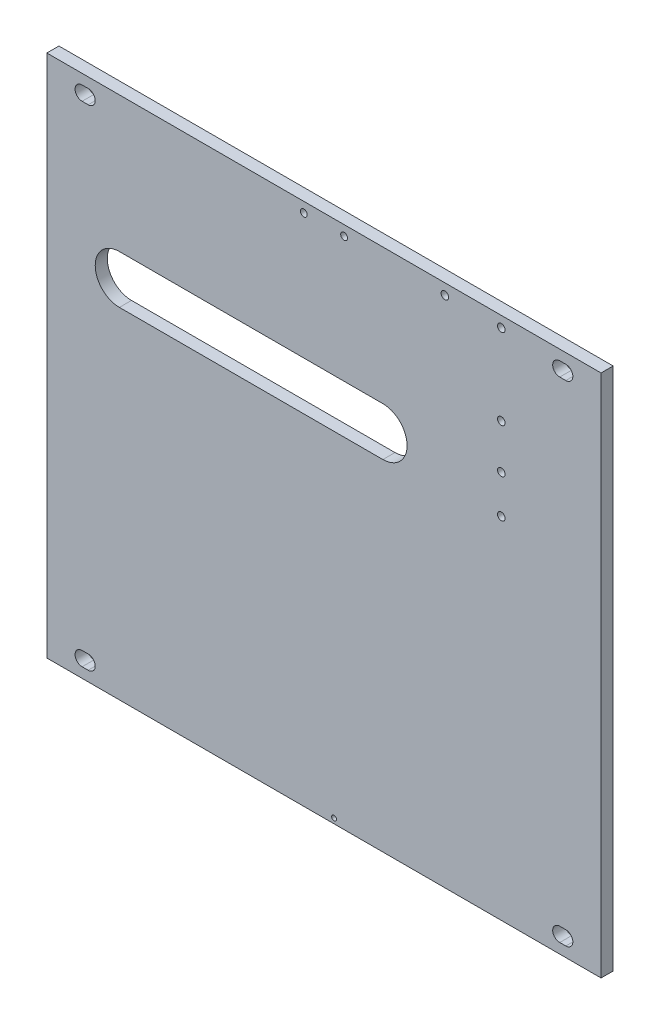
ISO-10303-21;
HEADER;
FILE_DESCRIPTION(('STEP AP214'),'2;1');
FILE_NAME('part.step','',(''),(''),'','','');
FILE_SCHEMA(('AUTOMOTIVE_DESIGN { 1 0 10303 214 1 1 1 1 }'));
ENDSEC;
DATA;
#1=APPLICATION_CONTEXT('core data for automotive mechanical design processes');
#2=APPLICATION_PROTOCOL_DEFINITION('international standard','automotive_design',2000,#1);
#3=PRODUCT_CONTEXT('',#1,'mechanical');
#4=PRODUCT('Part','Part','',(#3));
#5=PRODUCT_RELATED_PRODUCT_CATEGORY('part','',(#4));
#6=PRODUCT_DEFINITION_FORMATION('','',#4);
#7=PRODUCT_DEFINITION_CONTEXT('part definition',#1,'design');
#8=PRODUCT_DEFINITION('design','',#6,#7);
#9=PRODUCT_DEFINITION_SHAPE('','',#8);
#10=(LENGTH_UNIT() NAMED_UNIT(*) SI_UNIT(.MILLI.,.METRE.));
#11=(NAMED_UNIT(*) PLANE_ANGLE_UNIT() SI_UNIT($,.RADIAN.));
#12=(NAMED_UNIT(*) SI_UNIT($,.STERADIAN.) SOLID_ANGLE_UNIT());
#13=UNCERTAINTY_MEASURE_WITH_UNIT(LENGTH_MEASURE(1.E-05),#10,'distance_accuracy_value','');
#14=(GEOMETRIC_REPRESENTATION_CONTEXT(3) GLOBAL_UNCERTAINTY_ASSIGNED_CONTEXT((#13)) GLOBAL_UNIT_ASSIGNED_CONTEXT((#10,
#11,#12)) REPRESENTATION_CONTEXT('',''));
#15=CARTESIAN_POINT('',(0.,0.,0.));
#16=DIRECTION('',(0.,0.,1.));
#17=DIRECTION('',(1.,0.,0.));
#18=AXIS2_PLACEMENT_3D('',#15,#16,#17);
#19=CARTESIAN_POINT('',(137.5,130.,-6.));
#20=DIRECTION('',(1.,0.,0.));
#21=DIRECTION('',(0.,1.,0.));
#22=AXIS2_PLACEMENT_3D('',#19,#20,#21);
#23=PLANE('',#22);
#24=DIRECTION('',(0.,1.,0.));
#25=VECTOR('',#24,1.);
#26=CARTESIAN_POINT('',(137.5,130.,0.));
#27=LINE('',#26,#25);
#28=CARTESIAN_POINT('',(137.5,-130.,0.));
#29=VERTEX_POINT('',#28);
#30=CARTESIAN_POINT('',(137.5,130.,0.));
#31=VERTEX_POINT('',#30);
#32=EDGE_CURVE('E678',#29,#31,#27,.T.);
#33=ORIENTED_EDGE('',*,*,#32,.F.);
#34=DIRECTION('',(0.,0.,1.));
#35=VECTOR('',#34,1.);
#36=CARTESIAN_POINT('',(137.5,-130.,-6.));
#37=LINE('',#36,#35);
#38=CARTESIAN_POINT('',(137.5,-130.,-6.));
#39=VERTEX_POINT('',#38);
#40=EDGE_CURVE('E703',#39,#29,#37,.T.);
#41=ORIENTED_EDGE('',*,*,#40,.F.);
#42=DIRECTION('',(0.,1.,0.));
#43=VECTOR('',#42,1.);
#44=CARTESIAN_POINT('',(137.5,130.,-6.));
#45=LINE('',#44,#43);
#46=CARTESIAN_POINT('',(137.5,130.,-6.));
#47=VERTEX_POINT('',#46);
#48=EDGE_CURVE('E679',#39,#47,#45,.T.);
#49=ORIENTED_EDGE('',*,*,#48,.T.);
#50=DIRECTION('',(0.,0.,1.));
#51=VECTOR('',#50,1.);
#52=CARTESIAN_POINT('',(137.5,130.,-6.));
#53=LINE('',#52,#51);
#54=EDGE_CURVE('E692',#47,#31,#53,.T.);
#55=ORIENTED_EDGE('',*,*,#54,.T.);
#56=EDGE_LOOP('',(#33,#41,#49,#55));
#57=FACE_BOUND('',#56,.T.);
#58=ADVANCED_FACE('F336',(#57),#23,.T.);
#59=CARTESIAN_POINT('',(-137.5,-130.,-6.));
#60=DIRECTION('',(0.,-1.,0.));
#61=DIRECTION('',(0.,0.,-1.));
#62=AXIS2_PLACEMENT_3D('',#59,#60,#61);
#63=PLANE('',#62);
#64=DIRECTION('',(1.,0.,0.));
#65=VECTOR('',#64,1.);
#66=CARTESIAN_POINT('',(-137.5,-130.,0.));
#67=LINE('',#66,#65);
#68=CARTESIAN_POINT('',(-137.5,-130.,0.));
#69=VERTEX_POINT('',#68);
#70=EDGE_CURVE('E683',#69,#29,#67,.T.);
#71=ORIENTED_EDGE('',*,*,#70,.F.);
#72=DIRECTION('',(0.,0.,1.));
#73=VECTOR('',#72,1.);
#74=CARTESIAN_POINT('',(-137.5,-130.,-6.));
#75=LINE('',#74,#73);
#76=CARTESIAN_POINT('',(-137.5,-130.,-6.));
#77=VERTEX_POINT('',#76);
#78=EDGE_CURVE('E706',#77,#69,#75,.T.);
#79=ORIENTED_EDGE('',*,*,#78,.F.);
#80=DIRECTION('',(1.,0.,0.));
#81=VECTOR('',#80,1.);
#82=CARTESIAN_POINT('',(-137.5,-130.,-6.));
#83=LINE('',#82,#81);
#84=EDGE_CURVE('E689',#77,#39,#83,.T.);
#85=ORIENTED_EDGE('',*,*,#84,.T.);
#86=ORIENTED_EDGE('',*,*,#40,.T.);
#87=EDGE_LOOP('',(#71,#79,#85,#86));
#88=FACE_BOUND('',#87,.T.);
#89=ADVANCED_FACE('F755',(#88),#63,.T.);
#90=CARTESIAN_POINT('',(-137.5,130.,-6.));
#91=DIRECTION('',(-1.,0.,0.));
#92=DIRECTION('',(0.,0.,1.));
#93=AXIS2_PLACEMENT_3D('',#90,#91,#92);
#94=PLANE('',#93);
#95=DIRECTION('',(0.,-1.,0.));
#96=VECTOR('',#95,1.);
#97=CARTESIAN_POINT('',(-137.5,130.,0.));
#98=LINE('',#97,#96);
#99=CARTESIAN_POINT('',(-137.5,130.,0.));
#100=VERTEX_POINT('',#99);
#101=EDGE_CURVE('E698',#100,#69,#98,.T.);
#102=ORIENTED_EDGE('',*,*,#101,.F.);
#103=DIRECTION('',(0.,0.,1.));
#104=VECTOR('',#103,1.);
#105=CARTESIAN_POINT('',(-137.5,130.,-6.));
#106=LINE('',#105,#104);
#107=CARTESIAN_POINT('',(-137.5,130.,-6.));
#108=VERTEX_POINT('',#107);
#109=EDGE_CURVE('E708',#108,#100,#106,.T.);
#110=ORIENTED_EDGE('',*,*,#109,.F.);
#111=DIRECTION('',(0.,-1.,0.));
#112=VECTOR('',#111,1.);
#113=CARTESIAN_POINT('',(-137.5,130.,-6.));
#114=LINE('',#113,#112);
#115=EDGE_CURVE('E686',#108,#77,#114,.T.);
#116=ORIENTED_EDGE('',*,*,#115,.T.);
#117=ORIENTED_EDGE('',*,*,#78,.T.);
#118=EDGE_LOOP('',(#102,#110,#116,#117));
#119=FACE_BOUND('',#118,.T.);
#120=ADVANCED_FACE('F759',(#119),#94,.T.);
#121=CARTESIAN_POINT('',(-137.5,130.,-6.));
#122=DIRECTION('',(0.,1.,0.));
#123=DIRECTION('',(0.,0.,1.));
#124=AXIS2_PLACEMENT_3D('',#121,#122,#123);
#125=PLANE('',#124);
#126=DIRECTION('',(-1.,0.,0.));
#127=VECTOR('',#126,1.);
#128=CARTESIAN_POINT('',(-137.5,130.,0.));
#129=LINE('',#128,#127);
#130=EDGE_CURVE('E695',#31,#100,#129,.T.);
#131=ORIENTED_EDGE('',*,*,#130,.F.);
#132=ORIENTED_EDGE('',*,*,#54,.F.);
#133=DIRECTION('',(-1.,0.,0.));
#134=VECTOR('',#133,1.);
#135=CARTESIAN_POINT('',(-137.5,130.,-6.));
#136=LINE('',#135,#134);
#137=EDGE_CURVE('E682',#47,#108,#136,.T.);
#138=ORIENTED_EDGE('',*,*,#137,.T.);
#139=ORIENTED_EDGE('',*,*,#109,.T.);
#140=EDGE_LOOP('',(#131,#132,#138,#139));
#141=FACE_BOUND('',#140,.T.);
#142=ADVANCED_FACE('F735',(#141),#125,.T.);
#143=CARTESIAN_POINT('',(0.,0.,-6.));
#144=DIRECTION('',(0.,0.,1.));
#145=DIRECTION('',(1.,0.,0.));
#146=AXIS2_PLACEMENT_3D('',#143,#144,#145);
#147=PLANE('',#146);
#148=CARTESIAN_POINT('',(10.,125.,-6.00000000000001));
#149=DIRECTION('',(0.,0.,1.));
#150=DIRECTION('',(1.,0.,0.));
#151=AXIS2_PLACEMENT_3D('',#148,#149,#150);
#152=CIRCLE('',#151,1.69999999999999);
#153=CARTESIAN_POINT('',(11.7,125.,-6.00000000000001));
#154=VERTEX_POINT('',#153);
#155=EDGE_CURVE('E1173',#154,#154,#152,.T.);
#156=ORIENTED_EDGE('',*,*,#155,.T.);
#157=EDGE_LOOP('',(#156));
#158=FACE_BOUND('',#157,.T.);
#159=CARTESIAN_POINT('',(-10.,125.,-6.00000000000001));
#160=DIRECTION('',(0.,0.,1.));
#161=DIRECTION('',(1.,0.,0.));
#162=AXIS2_PLACEMENT_3D('',#159,#160,#161);
#163=CIRCLE('',#162,1.69999999999999);
#164=CARTESIAN_POINT('',(-8.30000000000001,125.,-6.00000000000001));
#165=VERTEX_POINT('',#164);
#166=EDGE_CURVE('E1166',#165,#165,#163,.T.);
#167=ORIENTED_EDGE('',*,*,#166,.T.);
#168=EDGE_LOOP('',(#167));
#169=FACE_BOUND('',#168,.T.);
#170=CARTESIAN_POINT('',(5.,-127.5,-6.00000000000001));
#171=DIRECTION('',(0.,0.,1.));
#172=DIRECTION('',(1.,0.,0.));
#173=AXIS2_PLACEMENT_3D('',#170,#171,#172);
#174=CIRCLE('',#173,1.20000000000001);
#175=CARTESIAN_POINT('',(6.20000000000001,-127.5,-6.00000000000001));
#176=VERTEX_POINT('',#175);
#177=EDGE_CURVE('E1160',#176,#176,#174,.T.);
#178=ORIENTED_EDGE('',*,*,#177,.T.);
#179=EDGE_LOOP('',(#178));
#180=FACE_BOUND('',#179,.T.);
#181=DIRECTION('',(1.,0.,0.));
#182=VECTOR('',#181,1.);
#183=CARTESIAN_POINT('',(117.,-125.,-6.00000000000001));
#184=LINE('',#183,#182);
#185=CARTESIAN_POINT('',(117.,-125.,-6.));
#186=VERTEX_POINT('',#185);
#187=CARTESIAN_POINT('',(120.,-125.,-6.00000000000001));
#188=VERTEX_POINT('',#187);
#189=EDGE_CURVE('E513',#186,#188,#184,.T.);
#190=ORIENTED_EDGE('',*,*,#189,.T.);
#191=CARTESIAN_POINT('',(120.,-121.5,-6.00000000000001));
#192=DIRECTION('',(0.,0.,1.));
#193=DIRECTION('',(1.,0.,0.));
#194=AXIS2_PLACEMENT_3D('',#191,#192,#193);
#195=CIRCLE('',#194,3.49999999999999);
#196=CARTESIAN_POINT('',(120.,-118.,-6.00000000000001));
#197=VERTEX_POINT('',#196);
#198=EDGE_CURVE('E512',#188,#197,#195,.T.);
#199=ORIENTED_EDGE('',*,*,#198,.T.);
#200=DIRECTION('',(1.,0.,0.));
#201=VECTOR('',#200,1.);
#202=CARTESIAN_POINT('',(117.,-118.,-6.00000000000001));
#203=LINE('',#202,#201);
#204=CARTESIAN_POINT('',(117.,-118.,-6.00000000000001));
#205=VERTEX_POINT('',#204);
#206=EDGE_CURVE('E495',#205,#197,#203,.T.);
#207=ORIENTED_EDGE('',*,*,#206,.F.);
#208=CARTESIAN_POINT('',(117.,-121.5,-6.00000000000001));
#209=DIRECTION('',(0.,0.,1.));
#210=DIRECTION('',(1.,0.,0.));
#211=AXIS2_PLACEMENT_3D('',#208,#209,#210);
#212=CIRCLE('',#211,3.49999999999999);
#213=EDGE_CURVE('E503',#205,#186,#212,.T.);
#214=ORIENTED_EDGE('',*,*,#213,.T.);
#215=EDGE_LOOP('',(#190,#199,#207,#214));
#216=FACE_BOUND('',#215,.T.);
#217=DIRECTION('',(1.,0.,0.));
#218=VECTOR('',#217,1.);
#219=CARTESIAN_POINT('',(-120.,-125.,-6.00000000000001));
#220=LINE('',#219,#218);
#221=CARTESIAN_POINT('',(-120.,-125.,-6.00000000000001));
#222=VERTEX_POINT('',#221);
#223=CARTESIAN_POINT('',(-117.,-125.,-6.00000000000001));
#224=VERTEX_POINT('',#223);
#225=EDGE_CURVE('E532',#222,#224,#220,.T.);
#226=ORIENTED_EDGE('',*,*,#225,.T.);
#227=CARTESIAN_POINT('',(-117.,-121.5,-6.00000000000001));
#228=DIRECTION('',(0.,0.,1.));
#229=DIRECTION('',(1.,0.,0.));
#230=AXIS2_PLACEMENT_3D('',#227,#228,#229);
#231=CIRCLE('',#230,3.49999999999999);
#232=CARTESIAN_POINT('',(-117.,-118.,-6.00000000000001));
#233=VERTEX_POINT('',#232);
#234=EDGE_CURVE('E554',#224,#233,#231,.T.);
#235=ORIENTED_EDGE('',*,*,#234,.T.);
#236=DIRECTION('',(1.,0.,0.));
#237=VECTOR('',#236,1.);
#238=CARTESIAN_POINT('',(-120.,-118.,-6.00000000000001));
#239=LINE('',#238,#237);
#240=CARTESIAN_POINT('',(-120.,-118.,-6.));
#241=VERTEX_POINT('',#240);
#242=EDGE_CURVE('E535',#241,#233,#239,.T.);
#243=ORIENTED_EDGE('',*,*,#242,.F.);
#244=CARTESIAN_POINT('',(-120.,-121.5,-6.00000000000001));
#245=DIRECTION('',(0.,0.,1.));
#246=DIRECTION('',(1.,0.,0.));
#247=AXIS2_PLACEMENT_3D('',#244,#245,#246);
#248=CIRCLE('',#247,3.49999999999999);
#249=EDGE_CURVE('E543',#241,#222,#248,.T.);
#250=ORIENTED_EDGE('',*,*,#249,.T.);
#251=EDGE_LOOP('',(#226,#235,#243,#250));
#252=FACE_BOUND('',#251,.T.);
#253=DIRECTION('',(1.,0.,0.));
#254=VECTOR('',#253,1.);
#255=CARTESIAN_POINT('',(-120.,118.,-6.00000000000001));
#256=LINE('',#255,#254);
#257=CARTESIAN_POINT('',(-120.,118.,-6.));
#258=VERTEX_POINT('',#257);
#259=CARTESIAN_POINT('',(-117.,118.,-6.00000000000001));
#260=VERTEX_POINT('',#259);
#261=EDGE_CURVE('E564',#258,#260,#256,.T.);
#262=ORIENTED_EDGE('',*,*,#261,.T.);
#263=CARTESIAN_POINT('',(-117.,121.5,-6.00000000000001));
#264=DIRECTION('',(0.,0.,1.));
#265=DIRECTION('',(1.,0.,0.));
#266=AXIS2_PLACEMENT_3D('',#263,#264,#265);
#267=CIRCLE('',#266,3.49999999999999);
#268=CARTESIAN_POINT('',(-117.,125.,-6.00000000000001));
#269=VERTEX_POINT('',#268);
#270=EDGE_CURVE('E585',#260,#269,#267,.T.);
#271=ORIENTED_EDGE('',*,*,#270,.T.);
#272=DIRECTION('',(1.,0.,0.));
#273=VECTOR('',#272,1.);
#274=CARTESIAN_POINT('',(-120.,125.,-6.00000000000001));
#275=LINE('',#274,#273);
#276=CARTESIAN_POINT('',(-120.,125.,-6.00000000000001));
#277=VERTEX_POINT('',#276);
#278=EDGE_CURVE('E567',#277,#269,#275,.T.);
#279=ORIENTED_EDGE('',*,*,#278,.F.);
#280=CARTESIAN_POINT('',(-120.,121.5,-6.00000000000001));
#281=DIRECTION('',(0.,0.,1.));
#282=DIRECTION('',(1.,0.,0.));
#283=AXIS2_PLACEMENT_3D('',#280,#281,#282);
#284=CIRCLE('',#283,3.49999999999999);
#285=EDGE_CURVE('E574',#277,#258,#284,.T.);
#286=ORIENTED_EDGE('',*,*,#285,.T.);
#287=EDGE_LOOP('',(#262,#271,#279,#286));
#288=FACE_BOUND('',#287,.T.);
#289=CARTESIAN_POINT('',(117.,121.5,-6.00000000000001));
#290=DIRECTION('',(0.,0.,1.));
#291=DIRECTION('',(1.,0.,0.));
#292=AXIS2_PLACEMENT_3D('',#289,#290,#291);
#293=CIRCLE('',#292,3.49999999999999);
#294=CARTESIAN_POINT('',(117.,125.,-6.));
#295=VERTEX_POINT('',#294);
#296=CARTESIAN_POINT('',(117.,118.,-6.00000000000001));
#297=VERTEX_POINT('',#296);
#298=EDGE_CURVE('E606',#295,#297,#293,.T.);
#299=ORIENTED_EDGE('',*,*,#298,.T.);
#300=DIRECTION('',(1.,0.,0.));
#301=VECTOR('',#300,1.);
#302=CARTESIAN_POINT('',(117.,118.,-6.00000000000001));
#303=LINE('',#302,#301);
#304=CARTESIAN_POINT('',(120.,118.,-6.00000000000001));
#305=VERTEX_POINT('',#304);
#306=EDGE_CURVE('E595',#297,#305,#303,.T.);
#307=ORIENTED_EDGE('',*,*,#306,.T.);
#308=CARTESIAN_POINT('',(120.,121.5,-6.00000000000001));
#309=DIRECTION('',(0.,0.,1.));
#310=DIRECTION('',(1.,0.,0.));
#311=AXIS2_PLACEMENT_3D('',#308,#309,#310);
#312=CIRCLE('',#311,3.49999999999999);
#313=CARTESIAN_POINT('',(120.,125.,-6.00000000000001));
#314=VERTEX_POINT('',#313);
#315=EDGE_CURVE('E617',#305,#314,#312,.T.);
#316=ORIENTED_EDGE('',*,*,#315,.T.);
#317=DIRECTION('',(1.,0.,0.));
#318=VECTOR('',#317,1.);
#319=CARTESIAN_POINT('',(117.,125.,-6.00000000000001));
#320=LINE('',#319,#318);
#321=EDGE_CURVE('E598',#295,#314,#320,.T.);
#322=ORIENTED_EDGE('',*,*,#321,.F.);
#323=EDGE_LOOP('',(#299,#307,#316,#322));
#324=FACE_BOUND('',#323,.T.);
#325=DIRECTION('',(-1.,0.,0.));
#326=VECTOR('',#325,1.);
#327=CARTESIAN_POINT('',(29.25,62.67,-6.));
#328=LINE('',#327,#326);
#329=CARTESIAN_POINT('',(29.25,62.67,-6.));
#330=VERTEX_POINT('',#329);
#331=CARTESIAN_POINT('',(-101.5,62.67,-6.));
#332=VERTEX_POINT('',#331);
#333=EDGE_CURVE('E634',#330,#332,#328,.T.);
#334=ORIENTED_EDGE('',*,*,#333,.T.);
#335=CARTESIAN_POINT('',(-101.5,50.67,-6.));
#336=DIRECTION('',(0.,0.,1.));
#337=DIRECTION('',(1.,0.,0.));
#338=AXIS2_PLACEMENT_3D('',#335,#336,#337);
#339=CIRCLE('',#338,12.);
#340=CARTESIAN_POINT('',(-101.5,38.67,-6.));
#341=VERTEX_POINT('',#340);
#342=EDGE_CURVE('E625',#332,#341,#339,.T.);
#343=ORIENTED_EDGE('',*,*,#342,.T.);
#344=DIRECTION('',(1.,0.,0.));
#345=VECTOR('',#344,1.);
#346=CARTESIAN_POINT('',(-101.5,38.67,-6.));
#347=LINE('',#346,#345);
#348=CARTESIAN_POINT('',(29.25,38.67,-6.));
#349=VERTEX_POINT('',#348);
#350=EDGE_CURVE('E628',#341,#349,#347,.T.);
#351=ORIENTED_EDGE('',*,*,#350,.T.);
#352=CARTESIAN_POINT('',(29.25,50.67,-6.));
#353=DIRECTION('',(0.,0.,1.));
#354=DIRECTION('',(1.,0.,0.));
#355=AXIS2_PLACEMENT_3D('',#352,#353,#354);
#356=CIRCLE('',#355,12.);
#357=EDGE_CURVE('E631',#349,#330,#356,.T.);
#358=ORIENTED_EDGE('',*,*,#357,.T.);
#359=EDGE_LOOP('',(#334,#343,#351,#358));
#360=FACE_BOUND('',#359,.T.);
#361=CARTESIAN_POINT('',(88.,62.63,-6.));
#362=DIRECTION('',(0.,0.,1.));
#363=DIRECTION('',(1.,0.,0.));
#364=AXIS2_PLACEMENT_3D('',#361,#362,#363);
#365=CIRCLE('',#364,1.875);
#366=CARTESIAN_POINT('',(89.875,62.63,-6.));
#367=VERTEX_POINT('',#366);
#368=EDGE_CURVE('E669',#367,#367,#365,.T.);
#369=ORIENTED_EDGE('',*,*,#368,.T.);
#370=EDGE_LOOP('',(#369));
#371=FACE_BOUND('',#370,.T.);
#372=CARTESIAN_POINT('',(88.,84.63,-6.));
#373=DIRECTION('',(0.,0.,1.));
#374=DIRECTION('',(1.,0.,0.));
#375=AXIS2_PLACEMENT_3D('',#372,#373,#374);
#376=CIRCLE('',#375,1.875);
#377=CARTESIAN_POINT('',(89.875,84.63,-6.));
#378=VERTEX_POINT('',#377);
#379=EDGE_CURVE('E666',#378,#378,#376,.T.);
#380=ORIENTED_EDGE('',*,*,#379,.T.);
#381=EDGE_LOOP('',(#380));
#382=FACE_BOUND('',#381,.T.);
#383=CARTESIAN_POINT('',(88.,124.63,-6.));
#384=DIRECTION('',(0.,0.,1.));
#385=DIRECTION('',(1.,0.,0.));
#386=AXIS2_PLACEMENT_3D('',#383,#384,#385);
#387=CIRCLE('',#386,1.875);
#388=CARTESIAN_POINT('',(89.875,124.63,-6.));
#389=VERTEX_POINT('',#388);
#390=EDGE_CURVE('E663',#389,#389,#387,.T.);
#391=ORIENTED_EDGE('',*,*,#390,.T.);
#392=EDGE_LOOP('',(#391));
#393=FACE_BOUND('',#392,.T.);
#394=CARTESIAN_POINT('',(60.,124.63,-6.));
#395=DIRECTION('',(0.,0.,1.));
#396=DIRECTION('',(1.,0.,0.));
#397=AXIS2_PLACEMENT_3D('',#394,#395,#396);
#398=CIRCLE('',#397,1.87500000000002);
#399=CARTESIAN_POINT('',(61.875,124.63,-6.));
#400=VERTEX_POINT('',#399);
#401=EDGE_CURVE('E652',#400,#400,#398,.T.);
#402=ORIENTED_EDGE('',*,*,#401,.T.);
#403=EDGE_LOOP('',(#402));
#404=FACE_BOUND('',#403,.T.);
#405=CARTESIAN_POINT('',(88.,43.63,-6.));
#406=DIRECTION('',(0.,0.,1.));
#407=DIRECTION('',(1.,0.,0.));
#408=AXIS2_PLACEMENT_3D('',#405,#406,#407);
#409=CIRCLE('',#408,1.875);
#410=CARTESIAN_POINT('',(89.875,43.63,-6.));
#411=VERTEX_POINT('',#410);
#412=EDGE_CURVE('E675',#411,#411,#409,.T.);
#413=ORIENTED_EDGE('',*,*,#412,.T.);
#414=EDGE_LOOP('',(#413));
#415=FACE_BOUND('',#414,.T.);
#416=ORIENTED_EDGE('',*,*,#48,.F.);
#417=ORIENTED_EDGE('',*,*,#84,.F.);
#418=ORIENTED_EDGE('',*,*,#115,.F.);
#419=ORIENTED_EDGE('',*,*,#137,.F.);
#420=EDGE_LOOP('',(#416,#417,#418,#419));
#421=FACE_BOUND('',#420,.T.);
#422=ADVANCED_FACE('F510',(#158,#169,#180,#216,#252,#288,#324,#360,#371,#382,#393,#404,#415,
#421),#147,.F.);
#423=CARTESIAN_POINT('',(0.,0.,0.));
#424=DIRECTION('',(0.,0.,1.));
#425=DIRECTION('',(1.,0.,0.));
#426=AXIS2_PLACEMENT_3D('',#423,#424,#425);
#427=PLANE('',#426);
#428=CARTESIAN_POINT('',(10.,125.,0.));
#429=DIRECTION('',(0.,0.,1.));
#430=DIRECTION('',(1.,0.,0.));
#431=AXIS2_PLACEMENT_3D('',#428,#429,#430);
#432=CIRCLE('',#431,1.69999999999999);
#433=CARTESIAN_POINT('',(11.7,125.,0.));
#434=VERTEX_POINT('',#433);
#435=EDGE_CURVE('E1176',#434,#434,#432,.T.);
#436=ORIENTED_EDGE('',*,*,#435,.F.);
#437=EDGE_LOOP('',(#436));
#438=FACE_BOUND('',#437,.T.);
#439=CARTESIAN_POINT('',(-10.,125.,0.));
#440=DIRECTION('',(0.,0.,1.));
#441=DIRECTION('',(1.,0.,0.));
#442=AXIS2_PLACEMENT_3D('',#439,#440,#441);
#443=CIRCLE('',#442,1.69999999999999);
#444=CARTESIAN_POINT('',(-8.30000000000001,125.,0.));
#445=VERTEX_POINT('',#444);
#446=EDGE_CURVE('E1170',#445,#445,#443,.T.);
#447=ORIENTED_EDGE('',*,*,#446,.F.);
#448=EDGE_LOOP('',(#447));
#449=FACE_BOUND('',#448,.T.);
#450=CARTESIAN_POINT('',(5.,-127.5,0.));
#451=DIRECTION('',(0.,0.,1.));
#452=DIRECTION('',(1.,0.,0.));
#453=AXIS2_PLACEMENT_3D('',#450,#451,#452);
#454=CIRCLE('',#453,1.20000000000001);
#455=CARTESIAN_POINT('',(6.20000000000001,-127.5,0.));
#456=VERTEX_POINT('',#455);
#457=EDGE_CURVE('E1162',#456,#456,#454,.T.);
#458=ORIENTED_EDGE('',*,*,#457,.F.);
#459=EDGE_LOOP('',(#458));
#460=FACE_BOUND('',#459,.T.);
#461=CARTESIAN_POINT('',(120.,-121.5,0.));
#462=DIRECTION('',(0.,0.,1.));
#463=DIRECTION('',(1.,0.,0.));
#464=AXIS2_PLACEMENT_3D('',#461,#462,#463);
#465=CIRCLE('',#464,3.49999999999999);
#466=CARTESIAN_POINT('',(120.,-125.,0.));
#467=VERTEX_POINT('',#466);
#468=CARTESIAN_POINT('',(120.,-118.,0.));
#469=VERTEX_POINT('',#468);
#470=EDGE_CURVE('E500',#467,#469,#465,.T.);
#471=ORIENTED_EDGE('',*,*,#470,.F.);
#472=DIRECTION('',(1.,0.,0.));
#473=VECTOR('',#472,1.);
#474=CARTESIAN_POINT('',(117.,-125.,0.));
#475=LINE('',#474,#473);
#476=CARTESIAN_POINT('',(117.,-125.,0.));
#477=VERTEX_POINT('',#476);
#478=EDGE_CURVE('E516',#477,#467,#475,.T.);
#479=ORIENTED_EDGE('',*,*,#478,.F.);
#480=CARTESIAN_POINT('',(117.,-121.5,0.));
#481=DIRECTION('',(0.,0.,1.));
#482=DIRECTION('',(1.,0.,0.));
#483=AXIS2_PLACEMENT_3D('',#480,#481,#482);
#484=CIRCLE('',#483,3.49999999999999);
#485=CARTESIAN_POINT('',(117.,-118.,0.));
#486=VERTEX_POINT('',#485);
#487=EDGE_CURVE('E507',#486,#477,#484,.T.);
#488=ORIENTED_EDGE('',*,*,#487,.F.);
#489=DIRECTION('',(1.,0.,0.));
#490=VECTOR('',#489,1.);
#491=CARTESIAN_POINT('',(117.,-118.,0.));
#492=LINE('',#491,#490);
#493=EDGE_CURVE('E498',#486,#469,#492,.T.);
#494=ORIENTED_EDGE('',*,*,#493,.T.);
#495=EDGE_LOOP('',(#471,#479,#488,#494));
#496=FACE_BOUND('',#495,.T.);
#497=CARTESIAN_POINT('',(-117.,-121.5,0.));
#498=DIRECTION('',(0.,0.,1.));
#499=DIRECTION('',(1.,0.,0.));
#500=AXIS2_PLACEMENT_3D('',#497,#498,#499);
#501=CIRCLE('',#500,3.49999999999999);
#502=CARTESIAN_POINT('',(-117.,-125.,0.));
#503=VERTEX_POINT('',#502);
#504=CARTESIAN_POINT('',(-117.,-118.,0.));
#505=VERTEX_POINT('',#504);
#506=EDGE_CURVE('E551',#503,#505,#501,.T.);
#507=ORIENTED_EDGE('',*,*,#506,.F.);
#508=DIRECTION('',(1.,0.,0.));
#509=VECTOR('',#508,1.);
#510=CARTESIAN_POINT('',(-120.,-125.,0.));
#511=LINE('',#510,#509);
#512=CARTESIAN_POINT('',(-120.,-125.,0.));
#513=VERTEX_POINT('',#512);
#514=EDGE_CURVE('E530',#513,#503,#511,.T.);
#515=ORIENTED_EDGE('',*,*,#514,.F.);
#516=CARTESIAN_POINT('',(-120.,-121.5,0.));
#517=DIRECTION('',(0.,0.,1.));
#518=DIRECTION('',(1.,0.,0.));
#519=AXIS2_PLACEMENT_3D('',#516,#517,#518);
#520=CIRCLE('',#519,3.49999999999999);
#521=CARTESIAN_POINT('',(-120.,-118.,0.));
#522=VERTEX_POINT('',#521);
#523=EDGE_CURVE('E540',#522,#513,#520,.T.);
#524=ORIENTED_EDGE('',*,*,#523,.F.);
#525=DIRECTION('',(1.,0.,0.));
#526=VECTOR('',#525,1.);
#527=CARTESIAN_POINT('',(-120.,-118.,0.));
#528=LINE('',#527,#526);
#529=EDGE_CURVE('E537',#522,#505,#528,.T.);
#530=ORIENTED_EDGE('',*,*,#529,.T.);
#531=EDGE_LOOP('',(#507,#515,#524,#530));
#532=FACE_BOUND('',#531,.T.);
#533=DIRECTION('',(1.,0.,0.));
#534=VECTOR('',#533,1.);
#535=CARTESIAN_POINT('',(-120.,125.,0.));
#536=LINE('',#535,#534);
#537=CARTESIAN_POINT('',(-120.,125.,0.));
#538=VERTEX_POINT('',#537);
#539=CARTESIAN_POINT('',(-117.,125.,0.));
#540=VERTEX_POINT('',#539);
#541=EDGE_CURVE('E569',#538,#540,#536,.T.);
#542=ORIENTED_EDGE('',*,*,#541,.T.);
#543=CARTESIAN_POINT('',(-117.,121.5,0.));
#544=DIRECTION('',(0.,0.,1.));
#545=DIRECTION('',(1.,0.,0.));
#546=AXIS2_PLACEMENT_3D('',#543,#544,#545);
#547=CIRCLE('',#546,3.49999999999999);
#548=CARTESIAN_POINT('',(-117.,118.,0.));
#549=VERTEX_POINT('',#548);
#550=EDGE_CURVE('E582',#549,#540,#547,.T.);
#551=ORIENTED_EDGE('',*,*,#550,.F.);
#552=DIRECTION('',(1.,0.,0.));
#553=VECTOR('',#552,1.);
#554=CARTESIAN_POINT('',(-120.,118.,0.));
#555=LINE('',#554,#553);
#556=CARTESIAN_POINT('',(-120.,118.,0.));
#557=VERTEX_POINT('',#556);
#558=EDGE_CURVE('E562',#557,#549,#555,.T.);
#559=ORIENTED_EDGE('',*,*,#558,.F.);
#560=CARTESIAN_POINT('',(-120.,121.5,0.));
#561=DIRECTION('',(0.,0.,1.));
#562=DIRECTION('',(1.,0.,0.));
#563=AXIS2_PLACEMENT_3D('',#560,#561,#562);
#564=CIRCLE('',#563,3.49999999999999);
#565=EDGE_CURVE('E572',#538,#557,#564,.T.);
#566=ORIENTED_EDGE('',*,*,#565,.F.);
#567=EDGE_LOOP('',(#542,#551,#559,#566));
#568=FACE_BOUND('',#567,.T.);
#569=DIRECTION('',(1.,0.,0.));
#570=VECTOR('',#569,1.);
#571=CARTESIAN_POINT('',(117.,118.,0.));
#572=LINE('',#571,#570);
#573=CARTESIAN_POINT('',(117.,118.,0.));
#574=VERTEX_POINT('',#573);
#575=CARTESIAN_POINT('',(120.,118.,0.));
#576=VERTEX_POINT('',#575);
#577=EDGE_CURVE('E593',#574,#576,#572,.T.);
#578=ORIENTED_EDGE('',*,*,#577,.F.);
#579=CARTESIAN_POINT('',(117.,121.5,0.));
#580=DIRECTION('',(0.,0.,1.));
#581=DIRECTION('',(1.,0.,0.));
#582=AXIS2_PLACEMENT_3D('',#579,#580,#581);
#583=CIRCLE('',#582,3.49999999999999);
#584=CARTESIAN_POINT('',(117.,125.,0.));
#585=VERTEX_POINT('',#584);
#586=EDGE_CURVE('E603',#585,#574,#583,.T.);
#587=ORIENTED_EDGE('',*,*,#586,.F.);
#588=DIRECTION('',(1.,0.,0.));
#589=VECTOR('',#588,1.);
#590=CARTESIAN_POINT('',(117.,125.,0.));
#591=LINE('',#590,#589);
#592=CARTESIAN_POINT('',(120.,125.,0.));
#593=VERTEX_POINT('',#592);
#594=EDGE_CURVE('E600',#585,#593,#591,.T.);
#595=ORIENTED_EDGE('',*,*,#594,.T.);
#596=CARTESIAN_POINT('',(120.,121.5,0.));
#597=DIRECTION('',(0.,0.,1.));
#598=DIRECTION('',(1.,0.,0.));
#599=AXIS2_PLACEMENT_3D('',#596,#597,#598);
#600=CIRCLE('',#599,3.49999999999999);
#601=EDGE_CURVE('E614',#576,#593,#600,.T.);
#602=ORIENTED_EDGE('',*,*,#601,.F.);
#603=EDGE_LOOP('',(#578,#587,#595,#602));
#604=FACE_BOUND('',#603,.T.);
#605=CARTESIAN_POINT('',(-101.5,50.67,0.));
#606=DIRECTION('',(0.,0.,1.));
#607=DIRECTION('',(1.,0.,0.));
#608=AXIS2_PLACEMENT_3D('',#605,#606,#607);
#609=CIRCLE('',#608,12.);
#610=CARTESIAN_POINT('',(-101.5,62.67,0.));
#611=VERTEX_POINT('',#610);
#612=CARTESIAN_POINT('',(-101.5,38.67,0.));
#613=VERTEX_POINT('',#612);
#614=EDGE_CURVE('E13',#611,#613,#609,.T.);
#615=ORIENTED_EDGE('',*,*,#614,.F.);
#616=DIRECTION('',(1.,0.,0.));
#617=VECTOR('',#616,1.);
#618=CARTESIAN_POINT('',(29.25,62.67,0.));
#619=LINE('',#618,#617);
#620=CARTESIAN_POINT('',(29.25,62.67,0.));
#621=VERTEX_POINT('',#620);
#622=EDGE_CURVE('E343',#621,#611,#619,.F.);
#623=ORIENTED_EDGE('',*,*,#622,.F.);
#624=CARTESIAN_POINT('',(29.25,50.67,0.));
#625=DIRECTION('',(0.,0.,1.));
#626=DIRECTION('',(1.,0.,0.));
#627=AXIS2_PLACEMENT_3D('',#624,#625,#626);
#628=CIRCLE('',#627,12.);
#629=CARTESIAN_POINT('',(29.25,38.67,0.));
#630=VERTEX_POINT('',#629);
#631=EDGE_CURVE('E712',#630,#621,#628,.T.);
#632=ORIENTED_EDGE('',*,*,#631,.F.);
#633=DIRECTION('',(1.,0.,0.));
#634=VECTOR('',#633,1.);
#635=CARTESIAN_POINT('',(-101.5,38.67,0.));
#636=LINE('',#635,#634);
#637=EDGE_CURVE('E705',#613,#630,#636,.T.);
#638=ORIENTED_EDGE('',*,*,#637,.F.);
#639=EDGE_LOOP('',(#615,#623,#632,#638));
#640=FACE_BOUND('',#639,.T.);
#641=CARTESIAN_POINT('',(88.,62.63,0.));
#642=DIRECTION('',(0.,0.,-1.));
#643=DIRECTION('',(-1.,0.,0.));
#644=AXIS2_PLACEMENT_3D('',#641,#642,#643);
#645=CIRCLE('',#644,1.875);
#646=CARTESIAN_POINT('',(86.125,62.63,0.));
#647=VERTEX_POINT('',#646);
#648=EDGE_CURVE('E649',#647,#647,#645,.T.);
#649=ORIENTED_EDGE('',*,*,#648,.T.);
#650=EDGE_LOOP('',(#649));
#651=FACE_BOUND('',#650,.T.);
#652=CARTESIAN_POINT('',(88.,84.63,0.));
#653=DIRECTION('',(0.,0.,-1.));
#654=DIRECTION('',(-1.,0.,0.));
#655=AXIS2_PLACEMENT_3D('',#652,#653,#654);
#656=CIRCLE('',#655,1.875);
#657=CARTESIAN_POINT('',(86.125,84.63,0.));
#658=VERTEX_POINT('',#657);
#659=EDGE_CURVE('E653',#658,#658,#656,.T.);
#660=ORIENTED_EDGE('',*,*,#659,.T.);
#661=EDGE_LOOP('',(#660));
#662=FACE_BOUND('',#661,.T.);
#663=CARTESIAN_POINT('',(88.,124.63,0.));
#664=DIRECTION('',(0.,0.,-1.));
#665=DIRECTION('',(-1.,0.,0.));
#666=AXIS2_PLACEMENT_3D('',#663,#664,#665);
#667=CIRCLE('',#666,1.875);
#668=CARTESIAN_POINT('',(86.125,124.63,0.));
#669=VERTEX_POINT('',#668);
#670=EDGE_CURVE('E656',#669,#669,#667,.T.);
#671=ORIENTED_EDGE('',*,*,#670,.T.);
#672=EDGE_LOOP('',(#671));
#673=FACE_BOUND('',#672,.T.);
#674=CARTESIAN_POINT('',(60.,124.63,0.));
#675=DIRECTION('',(0.,0.,-1.));
#676=DIRECTION('',(-1.,0.,0.));
#677=AXIS2_PLACEMENT_3D('',#674,#675,#676);
#678=CIRCLE('',#677,1.87500000000002);
#679=CARTESIAN_POINT('',(58.125,124.63,0.));
#680=VERTEX_POINT('',#679);
#681=EDGE_CURVE('E645',#680,#680,#678,.T.);
#682=ORIENTED_EDGE('',*,*,#681,.T.);
#683=EDGE_LOOP('',(#682));
#684=FACE_BOUND('',#683,.T.);
#685=CARTESIAN_POINT('',(88.,43.63,0.));
#686=DIRECTION('',(0.,0.,-1.));
#687=DIRECTION('',(-1.,0.,0.));
#688=AXIS2_PLACEMENT_3D('',#685,#686,#687);
#689=CIRCLE('',#688,1.875);
#690=CARTESIAN_POINT('',(86.125,43.63,0.));
#691=VERTEX_POINT('',#690);
#692=EDGE_CURVE('E672',#691,#691,#689,.T.);
#693=ORIENTED_EDGE('',*,*,#692,.T.);
#694=EDGE_LOOP('',(#693));
#695=FACE_BOUND('',#694,.T.);
#696=ORIENTED_EDGE('',*,*,#32,.T.);
#697=ORIENTED_EDGE('',*,*,#130,.T.);
#698=ORIENTED_EDGE('',*,*,#101,.T.);
#699=ORIENTED_EDGE('',*,*,#70,.T.);
#700=EDGE_LOOP('',(#696,#697,#698,#699));
#701=FACE_BOUND('',#700,.T.);
#702=ADVANCED_FACE('F724',(#438,#449,#460,#496,#532,#568,#604,#640,#651,#662,#673,#684,#695,
#701),#427,.T.);
#703=CARTESIAN_POINT('',(88.,43.63,0.));
#704=DIRECTION('',(0.,0.,-1.));
#705=DIRECTION('',(-1.,0.,0.));
#706=AXIS2_PLACEMENT_3D('',#703,#704,#705);
#707=CYLINDRICAL_SURFACE('',#706,1.875);
#708=ORIENTED_EDGE('',*,*,#692,.F.);
#709=EDGE_LOOP('',(#708));
#710=FACE_BOUND('',#709,.T.);
#711=ORIENTED_EDGE('',*,*,#412,.F.);
#712=EDGE_LOOP('',(#711));
#713=FACE_BOUND('',#712,.T.);
#714=ADVANCED_FACE('F764',(#710,#713),#707,.F.);
#715=CARTESIAN_POINT('',(60.,124.63,0.));
#716=DIRECTION('',(0.,0.,-1.));
#717=DIRECTION('',(-1.,0.,0.));
#718=AXIS2_PLACEMENT_3D('',#715,#716,#717);
#719=CYLINDRICAL_SURFACE('',#718,1.87500000000002);
#720=ORIENTED_EDGE('',*,*,#681,.F.);
#721=EDGE_LOOP('',(#720));
#722=FACE_BOUND('',#721,.T.);
#723=ORIENTED_EDGE('',*,*,#401,.F.);
#724=EDGE_LOOP('',(#723));
#725=FACE_BOUND('',#724,.T.);
#726=ADVANCED_FACE('F770',(#722,#725),#719,.F.);
#727=CARTESIAN_POINT('',(88.,124.63,0.));
#728=DIRECTION('',(0.,0.,-1.));
#729=DIRECTION('',(-1.,0.,0.));
#730=AXIS2_PLACEMENT_3D('',#727,#728,#729);
#731=CYLINDRICAL_SURFACE('',#730,1.875);
#732=ORIENTED_EDGE('',*,*,#670,.F.);
#733=EDGE_LOOP('',(#732));
#734=FACE_BOUND('',#733,.T.);
#735=ORIENTED_EDGE('',*,*,#390,.F.);
#736=EDGE_LOOP('',(#735));
#737=FACE_BOUND('',#736,.T.);
#738=ADVANCED_FACE('F911',(#734,#737),#731,.F.);
#739=CARTESIAN_POINT('',(88.,84.63,0.));
#740=DIRECTION('',(0.,0.,-1.));
#741=DIRECTION('',(-1.,0.,0.));
#742=AXIS2_PLACEMENT_3D('',#739,#740,#741);
#743=CYLINDRICAL_SURFACE('',#742,1.875);
#744=ORIENTED_EDGE('',*,*,#659,.F.);
#745=EDGE_LOOP('',(#744));
#746=FACE_BOUND('',#745,.T.);
#747=ORIENTED_EDGE('',*,*,#379,.F.);
#748=EDGE_LOOP('',(#747));
#749=FACE_BOUND('',#748,.T.);
#750=ADVANCED_FACE('F907',(#746,#749),#743,.F.);
#751=CARTESIAN_POINT('',(88.,62.63,0.));
#752=DIRECTION('',(0.,0.,-1.));
#753=DIRECTION('',(-1.,0.,0.));
#754=AXIS2_PLACEMENT_3D('',#751,#752,#753);
#755=CYLINDRICAL_SURFACE('',#754,1.875);
#756=ORIENTED_EDGE('',*,*,#648,.F.);
#757=EDGE_LOOP('',(#756));
#758=FACE_BOUND('',#757,.T.);
#759=ORIENTED_EDGE('',*,*,#368,.F.);
#760=EDGE_LOOP('',(#759));
#761=FACE_BOUND('',#760,.T.);
#762=ADVANCED_FACE('F904',(#758,#761),#755,.F.);
#763=CARTESIAN_POINT('',(-101.5,50.67,-6.));
#764=DIRECTION('',(0.,0.,1.));
#765=DIRECTION('',(1.,0.,0.));
#766=AXIS2_PLACEMENT_3D('',#763,#764,#765);
#767=CYLINDRICAL_SURFACE('',#766,12.);
#768=ORIENTED_EDGE('',*,*,#614,.T.);
#769=DIRECTION('',(0.,0.,1.));
#770=VECTOR('',#769,1.);
#771=CARTESIAN_POINT('',(-101.5,38.67,-6.));
#772=LINE('',#771,#770);
#773=EDGE_CURVE('E637',#341,#613,#772,.T.);
#774=ORIENTED_EDGE('',*,*,#773,.F.);
#775=ORIENTED_EDGE('',*,*,#342,.F.);
#776=DIRECTION('',(0.,0.,1.));
#777=VECTOR('',#776,1.);
#778=CARTESIAN_POINT('',(-101.5,62.67,-6.));
#779=LINE('',#778,#777);
#780=EDGE_CURVE('E641',#332,#611,#779,.T.);
#781=ORIENTED_EDGE('',*,*,#780,.T.);
#782=EDGE_LOOP('',(#768,#774,#775,#781));
#783=FACE_BOUND('',#782,.T.);
#784=ADVANCED_FACE('F722',(#783),#767,.F.);
#785=CARTESIAN_POINT('',(29.25,62.67,-6.));
#786=DIRECTION('',(0.,1.,0.));
#787=DIRECTION('',(0.,0.,1.));
#788=AXIS2_PLACEMENT_3D('',#785,#786,#787);
#789=PLANE('',#788);
#790=ORIENTED_EDGE('',*,*,#622,.T.);
#791=ORIENTED_EDGE('',*,*,#780,.F.);
#792=ORIENTED_EDGE('',*,*,#333,.F.);
#793=DIRECTION('',(0.,0.,1.));
#794=VECTOR('',#793,1.);
#795=CARTESIAN_POINT('',(29.25,62.67,-6.));
#796=LINE('',#795,#794);
#797=EDGE_CURVE('E638',#330,#621,#796,.T.);
#798=ORIENTED_EDGE('',*,*,#797,.T.);
#799=EDGE_LOOP('',(#790,#791,#792,#798));
#800=FACE_BOUND('',#799,.T.);
#801=ADVANCED_FACE('F715',(#800),#789,.F.);
#802=CARTESIAN_POINT('',(29.25,50.67,-6.));
#803=DIRECTION('',(0.,0.,1.));
#804=DIRECTION('',(1.,0.,0.));
#805=AXIS2_PLACEMENT_3D('',#802,#803,#804);
#806=CYLINDRICAL_SURFACE('',#805,12.);
#807=ORIENTED_EDGE('',*,*,#631,.T.);
#808=ORIENTED_EDGE('',*,*,#797,.F.);
#809=ORIENTED_EDGE('',*,*,#357,.F.);
#810=DIRECTION('',(0.,0.,1.));
#811=VECTOR('',#810,1.);
#812=CARTESIAN_POINT('',(29.25,38.67,-6.));
#813=LINE('',#812,#811);
#814=EDGE_CURVE('E642',#349,#630,#813,.T.);
#815=ORIENTED_EDGE('',*,*,#814,.T.);
#816=EDGE_LOOP('',(#807,#808,#809,#815));
#817=FACE_BOUND('',#816,.T.);
#818=ADVANCED_FACE('F731',(#817),#806,.F.);
#819=CARTESIAN_POINT('',(-101.5,38.67,-6.));
#820=DIRECTION('',(0.,-1.,0.));
#821=DIRECTION('',(0.,0.,-1.));
#822=AXIS2_PLACEMENT_3D('',#819,#820,#821);
#823=PLANE('',#822);
#824=ORIENTED_EDGE('',*,*,#637,.T.);
#825=ORIENTED_EDGE('',*,*,#814,.F.);
#826=ORIENTED_EDGE('',*,*,#350,.F.);
#827=ORIENTED_EDGE('',*,*,#773,.T.);
#828=EDGE_LOOP('',(#824,#825,#826,#827));
#829=FACE_BOUND('',#828,.T.);
#830=ADVANCED_FACE('F728',(#829),#823,.F.);
#831=CARTESIAN_POINT('',(120.,121.5,0.));
#832=DIRECTION('',(0.,0.,1.));
#833=DIRECTION('',(1.,0.,0.));
#834=AXIS2_PLACEMENT_3D('',#831,#832,#833);
#835=CYLINDRICAL_SURFACE('',#834,3.49999999999999);
#836=ORIENTED_EDGE('',*,*,#315,.F.);
#837=DIRECTION('',(0.,0.,1.));
#838=VECTOR('',#837,1.);
#839=CARTESIAN_POINT('',(120.,118.,0.));
#840=LINE('',#839,#838);
#841=EDGE_CURVE('E622',#576,#305,#840,.F.);
#842=ORIENTED_EDGE('',*,*,#841,.F.);
#843=ORIENTED_EDGE('',*,*,#601,.T.);
#844=DIRECTION('',(0.,0.,1.));
#845=VECTOR('',#844,1.);
#846=CARTESIAN_POINT('',(120.,125.,0.));
#847=LINE('',#846,#845);
#848=EDGE_CURVE('E620',#314,#593,#847,.T.);
#849=ORIENTED_EDGE('',*,*,#848,.F.);
#850=EDGE_LOOP('',(#836,#842,#843,#849));
#851=FACE_BOUND('',#850,.T.);
#852=ADVANCED_FACE('F891',(#851),#835,.F.);
#853=CARTESIAN_POINT('',(117.,121.5,0.));
#854=DIRECTION('',(0.,0.,1.));
#855=DIRECTION('',(1.,0.,0.));
#856=AXIS2_PLACEMENT_3D('',#853,#854,#855);
#857=CYLINDRICAL_SURFACE('',#856,3.49999999999999);
#858=ORIENTED_EDGE('',*,*,#586,.T.);
#859=DIRECTION('',(0.,0.,1.));
#860=VECTOR('',#859,1.);
#861=CARTESIAN_POINT('',(117.,118.,0.));
#862=LINE('',#861,#860);
#863=EDGE_CURVE('E609',#297,#574,#862,.T.);
#864=ORIENTED_EDGE('',*,*,#863,.F.);
#865=ORIENTED_EDGE('',*,*,#298,.F.);
#866=DIRECTION('',(0.,0.,1.));
#867=VECTOR('',#866,1.);
#868=CARTESIAN_POINT('',(117.,125.,0.));
#869=LINE('',#868,#867);
#870=EDGE_CURVE('E611',#585,#295,#869,.F.);
#871=ORIENTED_EDGE('',*,*,#870,.F.);
#872=EDGE_LOOP('',(#858,#864,#865,#871));
#873=FACE_BOUND('',#872,.T.);
#874=ADVANCED_FACE('F887',(#873),#857,.F.);
#875=CARTESIAN_POINT('',(117.,125.,0.));
#876=DIRECTION('',(0.,1.,0.));
#877=DIRECTION('',(0.,0.,1.));
#878=AXIS2_PLACEMENT_3D('',#875,#876,#877);
#879=PLANE('',#878);
#880=ORIENTED_EDGE('',*,*,#848,.T.);
#881=ORIENTED_EDGE('',*,*,#594,.F.);
#882=ORIENTED_EDGE('',*,*,#870,.T.);
#883=ORIENTED_EDGE('',*,*,#321,.T.);
#884=EDGE_LOOP('',(#880,#881,#882,#883));
#885=FACE_BOUND('',#884,.T.);
#886=ADVANCED_FACE('F883',(#885),#879,.F.);
#887=CARTESIAN_POINT('',(117.,118.,0.));
#888=DIRECTION('',(0.,-1.,0.));
#889=DIRECTION('',(0.,0.,-1.));
#890=AXIS2_PLACEMENT_3D('',#887,#888,#889);
#891=PLANE('',#890);
#892=ORIENTED_EDGE('',*,*,#841,.T.);
#893=ORIENTED_EDGE('',*,*,#306,.F.);
#894=ORIENTED_EDGE('',*,*,#863,.T.);
#895=ORIENTED_EDGE('',*,*,#577,.T.);
#896=EDGE_LOOP('',(#892,#893,#894,#895));
#897=FACE_BOUND('',#896,.T.);
#898=ADVANCED_FACE('F879',(#897),#891,.F.);
#899=CARTESIAN_POINT('',(-117.,121.5,0.));
#900=DIRECTION('',(0.,0.,1.));
#901=DIRECTION('',(1.,0.,0.));
#902=AXIS2_PLACEMENT_3D('',#899,#900,#901);
#903=CYLINDRICAL_SURFACE('',#902,3.49999999999999);
#904=ORIENTED_EDGE('',*,*,#270,.F.);
#905=DIRECTION('',(0.,0.,1.));
#906=VECTOR('',#905,1.);
#907=CARTESIAN_POINT('',(-117.,118.,0.));
#908=LINE('',#907,#906);
#909=EDGE_CURVE('E590',#549,#260,#908,.F.);
#910=ORIENTED_EDGE('',*,*,#909,.F.);
#911=ORIENTED_EDGE('',*,*,#550,.T.);
#912=DIRECTION('',(0.,0.,1.));
#913=VECTOR('',#912,1.);
#914=CARTESIAN_POINT('',(-117.,125.,0.));
#915=LINE('',#914,#913);
#916=EDGE_CURVE('E588',#269,#540,#915,.T.);
#917=ORIENTED_EDGE('',*,*,#916,.F.);
#918=EDGE_LOOP('',(#904,#910,#911,#917));
#919=FACE_BOUND('',#918,.T.);
#920=ADVANCED_FACE('F875',(#919),#903,.F.);
#921=CARTESIAN_POINT('',(-120.,121.5,0.));
#922=DIRECTION('',(0.,0.,1.));
#923=DIRECTION('',(1.,0.,0.));
#924=AXIS2_PLACEMENT_3D('',#921,#922,#923);
#925=CYLINDRICAL_SURFACE('',#924,3.49999999999999);
#926=ORIENTED_EDGE('',*,*,#565,.T.);
#927=DIRECTION('',(0.,0.,1.));
#928=VECTOR('',#927,1.);
#929=CARTESIAN_POINT('',(-120.,118.,0.));
#930=LINE('',#929,#928);
#931=EDGE_CURVE('E577',#258,#557,#930,.T.);
#932=ORIENTED_EDGE('',*,*,#931,.F.);
#933=ORIENTED_EDGE('',*,*,#285,.F.);
#934=DIRECTION('',(0.,0.,1.));
#935=VECTOR('',#934,1.);
#936=CARTESIAN_POINT('',(-120.,125.,0.));
#937=LINE('',#936,#935);
#938=EDGE_CURVE('E580',#538,#277,#937,.F.);
#939=ORIENTED_EDGE('',*,*,#938,.F.);
#940=EDGE_LOOP('',(#926,#932,#933,#939));
#941=FACE_BOUND('',#940,.T.);
#942=ADVANCED_FACE('F871',(#941),#925,.F.);
#943=CARTESIAN_POINT('',(-120.,125.,0.));
#944=DIRECTION('',(0.,1.,0.));
#945=DIRECTION('',(0.,0.,1.));
#946=AXIS2_PLACEMENT_3D('',#943,#944,#945);
#947=PLANE('',#946);
#948=ORIENTED_EDGE('',*,*,#916,.T.);
#949=ORIENTED_EDGE('',*,*,#541,.F.);
#950=ORIENTED_EDGE('',*,*,#938,.T.);
#951=ORIENTED_EDGE('',*,*,#278,.T.);
#952=EDGE_LOOP('',(#948,#949,#950,#951));
#953=FACE_BOUND('',#952,.T.);
#954=ADVANCED_FACE('F867',(#953),#947,.F.);
#955=CARTESIAN_POINT('',(-120.,118.,0.));
#956=DIRECTION('',(0.,-1.,0.));
#957=DIRECTION('',(0.,0.,-1.));
#958=AXIS2_PLACEMENT_3D('',#955,#956,#957);
#959=PLANE('',#958);
#960=ORIENTED_EDGE('',*,*,#909,.T.);
#961=ORIENTED_EDGE('',*,*,#261,.F.);
#962=ORIENTED_EDGE('',*,*,#931,.T.);
#963=ORIENTED_EDGE('',*,*,#558,.T.);
#964=EDGE_LOOP('',(#960,#961,#962,#963));
#965=FACE_BOUND('',#964,.T.);
#966=ADVANCED_FACE('F863',(#965),#959,.F.);
#967=CARTESIAN_POINT('',(-117.,-121.5,0.));
#968=DIRECTION('',(0.,0.,1.));
#969=DIRECTION('',(1.,0.,0.));
#970=AXIS2_PLACEMENT_3D('',#967,#968,#969);
#971=CYLINDRICAL_SURFACE('',#970,3.49999999999999);
#972=ORIENTED_EDGE('',*,*,#234,.F.);
#973=DIRECTION('',(0.,0.,1.));
#974=VECTOR('',#973,1.);
#975=CARTESIAN_POINT('',(-117.,-125.,0.));
#976=LINE('',#975,#974);
#977=EDGE_CURVE('E559',#503,#224,#976,.F.);
#978=ORIENTED_EDGE('',*,*,#977,.F.);
#979=ORIENTED_EDGE('',*,*,#506,.T.);
#980=DIRECTION('',(0.,0.,1.));
#981=VECTOR('',#980,1.);
#982=CARTESIAN_POINT('',(-117.,-118.,0.));
#983=LINE('',#982,#981);
#984=EDGE_CURVE('E557',#233,#505,#983,.T.);
#985=ORIENTED_EDGE('',*,*,#984,.F.);
#986=EDGE_LOOP('',(#972,#978,#979,#985));
#987=FACE_BOUND('',#986,.T.);
#988=ADVANCED_FACE('F859',(#987),#971,.F.);
#989=CARTESIAN_POINT('',(-120.,-121.5,0.));
#990=DIRECTION('',(0.,0.,1.));
#991=DIRECTION('',(1.,0.,0.));
#992=AXIS2_PLACEMENT_3D('',#989,#990,#991);
#993=CYLINDRICAL_SURFACE('',#992,3.49999999999999);
#994=ORIENTED_EDGE('',*,*,#523,.T.);
#995=DIRECTION('',(0.,0.,1.));
#996=VECTOR('',#995,1.);
#997=CARTESIAN_POINT('',(-120.,-125.,0.));
#998=LINE('',#997,#996);
#999=EDGE_CURVE('E546',#222,#513,#998,.T.);
#1000=ORIENTED_EDGE('',*,*,#999,.F.);
#1001=ORIENTED_EDGE('',*,*,#249,.F.);
#1002=DIRECTION('',(0.,0.,1.));
#1003=VECTOR('',#1002,1.);
#1004=CARTESIAN_POINT('',(-120.,-118.,0.));
#1005=LINE('',#1004,#1003);
#1006=EDGE_CURVE('E548',#522,#241,#1005,.F.);
#1007=ORIENTED_EDGE('',*,*,#1006,.F.);
#1008=EDGE_LOOP('',(#994,#1000,#1001,#1007));
#1009=FACE_BOUND('',#1008,.T.);
#1010=ADVANCED_FACE('F855',(#1009),#993,.F.);
#1011=CARTESIAN_POINT('',(-120.,-118.,0.));
#1012=DIRECTION('',(0.,1.,0.));
#1013=DIRECTION('',(0.,0.,1.));
#1014=AXIS2_PLACEMENT_3D('',#1011,#1012,#1013);
#1015=PLANE('',#1014);
#1016=ORIENTED_EDGE('',*,*,#984,.T.);
#1017=ORIENTED_EDGE('',*,*,#529,.F.);
#1018=ORIENTED_EDGE('',*,*,#1006,.T.);
#1019=ORIENTED_EDGE('',*,*,#242,.T.);
#1020=EDGE_LOOP('',(#1016,#1017,#1018,#1019));
#1021=FACE_BOUND('',#1020,.T.);
#1022=ADVANCED_FACE('F851',(#1021),#1015,.F.);
#1023=CARTESIAN_POINT('',(-120.,-125.,0.));
#1024=DIRECTION('',(0.,-1.,0.));
#1025=DIRECTION('',(0.,0.,-1.));
#1026=AXIS2_PLACEMENT_3D('',#1023,#1024,#1025);
#1027=PLANE('',#1026);
#1028=ORIENTED_EDGE('',*,*,#977,.T.);
#1029=ORIENTED_EDGE('',*,*,#225,.F.);
#1030=ORIENTED_EDGE('',*,*,#999,.T.);
#1031=ORIENTED_EDGE('',*,*,#514,.T.);
#1032=EDGE_LOOP('',(#1028,#1029,#1030,#1031));
#1033=FACE_BOUND('',#1032,.T.);
#1034=ADVANCED_FACE('F847',(#1033),#1027,.F.);
#1035=CARTESIAN_POINT('',(120.,-121.5,0.));
#1036=DIRECTION('',(0.,0.,1.));
#1037=DIRECTION('',(1.,0.,0.));
#1038=AXIS2_PLACEMENT_3D('',#1035,#1036,#1037);
#1039=CYLINDRICAL_SURFACE('',#1038,3.49999999999999);
#1040=ORIENTED_EDGE('',*,*,#198,.F.);
#1041=DIRECTION('',(0.,0.,1.));
#1042=VECTOR('',#1041,1.);
#1043=CARTESIAN_POINT('',(120.,-125.,0.));
#1044=LINE('',#1043,#1042);
#1045=EDGE_CURVE('E527',#467,#188,#1044,.F.);
#1046=ORIENTED_EDGE('',*,*,#1045,.F.);
#1047=ORIENTED_EDGE('',*,*,#470,.T.);
#1048=DIRECTION('',(0.,0.,1.));
#1049=VECTOR('',#1048,1.);
#1050=CARTESIAN_POINT('',(120.,-118.,0.));
#1051=LINE('',#1050,#1049);
#1052=EDGE_CURVE('E525',#197,#469,#1051,.T.);
#1053=ORIENTED_EDGE('',*,*,#1052,.F.);
#1054=EDGE_LOOP('',(#1040,#1046,#1047,#1053));
#1055=FACE_BOUND('',#1054,.T.);
#1056=ADVANCED_FACE('F844',(#1055),#1039,.F.);
#1057=CARTESIAN_POINT('',(117.,-121.5,0.));
#1058=DIRECTION('',(0.,0.,1.));
#1059=DIRECTION('',(1.,0.,0.));
#1060=AXIS2_PLACEMENT_3D('',#1057,#1058,#1059);
#1061=CYLINDRICAL_SURFACE('',#1060,3.49999999999999);
#1062=ORIENTED_EDGE('',*,*,#487,.T.);
#1063=DIRECTION('',(0.,0.,1.));
#1064=VECTOR('',#1063,1.);
#1065=CARTESIAN_POINT('',(117.,-125.,0.));
#1066=LINE('',#1065,#1064);
#1067=EDGE_CURVE('E350',#186,#477,#1066,.T.);
#1068=ORIENTED_EDGE('',*,*,#1067,.F.);
#1069=ORIENTED_EDGE('',*,*,#213,.F.);
#1070=DIRECTION('',(0.,0.,1.));
#1071=VECTOR('',#1070,1.);
#1072=CARTESIAN_POINT('',(117.,-118.,0.));
#1073=LINE('',#1072,#1071);
#1074=EDGE_CURVE('E355',#486,#205,#1073,.F.);
#1075=ORIENTED_EDGE('',*,*,#1074,.F.);
#1076=EDGE_LOOP('',(#1062,#1068,#1069,#1075));
#1077=FACE_BOUND('',#1076,.T.);
#1078=ADVANCED_FACE('F504',(#1077),#1061,.F.);
#1079=CARTESIAN_POINT('',(117.,-118.,0.));
#1080=DIRECTION('',(0.,1.,0.));
#1081=DIRECTION('',(0.,0.,1.));
#1082=AXIS2_PLACEMENT_3D('',#1079,#1080,#1081);
#1083=PLANE('',#1082);
#1084=ORIENTED_EDGE('',*,*,#1052,.T.);
#1085=ORIENTED_EDGE('',*,*,#493,.F.);
#1086=ORIENTED_EDGE('',*,*,#1074,.T.);
#1087=ORIENTED_EDGE('',*,*,#206,.T.);
#1088=EDGE_LOOP('',(#1084,#1085,#1086,#1087));
#1089=FACE_BOUND('',#1088,.T.);
#1090=ADVANCED_FACE('F493',(#1089),#1083,.F.);
#1091=CARTESIAN_POINT('',(117.,-125.,0.));
#1092=DIRECTION('',(0.,-1.,0.));
#1093=DIRECTION('',(0.,0.,-1.));
#1094=AXIS2_PLACEMENT_3D('',#1091,#1092,#1093);
#1095=PLANE('',#1094);
#1096=ORIENTED_EDGE('',*,*,#1045,.T.);
#1097=ORIENTED_EDGE('',*,*,#189,.F.);
#1098=ORIENTED_EDGE('',*,*,#1067,.T.);
#1099=ORIENTED_EDGE('',*,*,#478,.T.);
#1100=EDGE_LOOP('',(#1096,#1097,#1098,#1099));
#1101=FACE_BOUND('',#1100,.T.);
#1102=ADVANCED_FACE('F835',(#1101),#1095,.F.);
#1103=CARTESIAN_POINT('',(5.,-127.5,-6.00000000000001));
#1104=DIRECTION('',(0.,0.,1.));
#1105=DIRECTION('',(1.,0.,0.));
#1106=AXIS2_PLACEMENT_3D('',#1103,#1104,#1105);
#1107=CYLINDRICAL_SURFACE('',#1106,1.20000000000001);
#1108=ORIENTED_EDGE('',*,*,#177,.F.);
#1109=EDGE_LOOP('',(#1108));
#1110=FACE_BOUND('',#1109,.T.);
#1111=ORIENTED_EDGE('',*,*,#457,.T.);
#1112=EDGE_LOOP('',(#1111));
#1113=FACE_BOUND('',#1112,.T.);
#1114=ADVANCED_FACE('F801',(#1110,#1113),#1107,.F.);
#1115=CARTESIAN_POINT('',(-10.,125.,0.));
#1116=DIRECTION('',(0.,0.,1.));
#1117=DIRECTION('',(1.,0.,0.));
#1118=AXIS2_PLACEMENT_3D('',#1115,#1116,#1117);
#1119=CYLINDRICAL_SURFACE('',#1118,1.69999999999999);
#1120=ORIENTED_EDGE('',*,*,#166,.F.);
#1121=EDGE_LOOP('',(#1120));
#1122=FACE_BOUND('',#1121,.T.);
#1123=ORIENTED_EDGE('',*,*,#446,.T.);
#1124=EDGE_LOOP('',(#1123));
#1125=FACE_BOUND('',#1124,.T.);
#1126=ADVANCED_FACE('F812',(#1122,#1125),#1119,.F.);
#1127=CARTESIAN_POINT('',(10.,125.,0.));
#1128=DIRECTION('',(0.,0.,1.));
#1129=DIRECTION('',(1.,0.,0.));
#1130=AXIS2_PLACEMENT_3D('',#1127,#1128,#1129);
#1131=CYLINDRICAL_SURFACE('',#1130,1.69999999999999);
#1132=ORIENTED_EDGE('',*,*,#155,.F.);
#1133=EDGE_LOOP('',(#1132));
#1134=FACE_BOUND('',#1133,.T.);
#1135=ORIENTED_EDGE('',*,*,#435,.T.);
#1136=EDGE_LOOP('',(#1135));
#1137=FACE_BOUND('',#1136,.T.);
#1138=ADVANCED_FACE('F817',(#1134,#1137),#1131,.F.);
#1139=CLOSED_SHELL('',(#58,#89,#120,#142,#422,#702,#714,#726,#738,#750,#762,#784,#801,#818,#830,
#852,#874,#886,#898,#920,#942,#954,#966,#988,#1010,#1022,#1034,#1056,#1078,#1090,#1102,#1114,
#1126,#1138));
#1140=MANIFOLD_SOLID_BREP('B2',#1139);
#1141=ADVANCED_BREP_SHAPE_REPRESENTATION('',(#18,#1140),#14);
#1142=SHAPE_DEFINITION_REPRESENTATION(#9,#1141);
ENDSEC;
END-ISO-10303-21;
